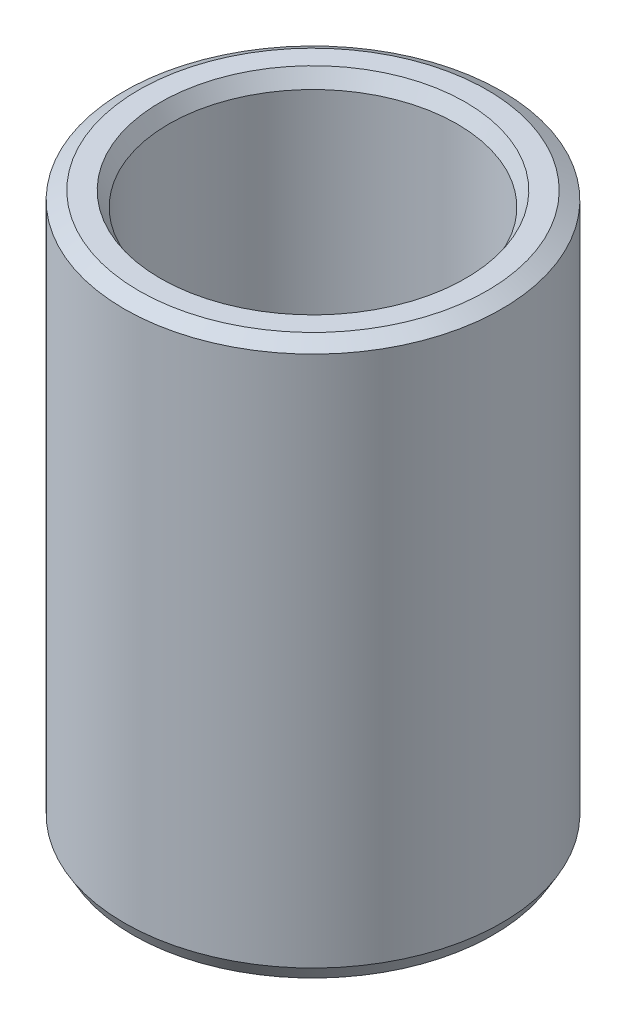
ISO-10303-21;
HEADER;
FILE_DESCRIPTION(('STEP AP214'),'2;1');
FILE_NAME('part.step','',(''),(''),'','','');
FILE_SCHEMA(('AUTOMOTIVE_DESIGN { 1 0 10303 214 1 1 1 1 }'));
ENDSEC;
DATA;
#1=APPLICATION_CONTEXT('core data for automotive mechanical design processes');
#2=APPLICATION_PROTOCOL_DEFINITION('international standard','automotive_design',2000,#1);
#3=PRODUCT_CONTEXT('',#1,'mechanical');
#4=PRODUCT('Part','Part','',(#3));
#5=PRODUCT_RELATED_PRODUCT_CATEGORY('part','',(#4));
#6=PRODUCT_DEFINITION_FORMATION('','',#4);
#7=PRODUCT_DEFINITION_CONTEXT('part definition',#1,'design');
#8=PRODUCT_DEFINITION('design','',#6,#7);
#9=PRODUCT_DEFINITION_SHAPE('','',#8);
#10=(LENGTH_UNIT() NAMED_UNIT(*) SI_UNIT(.MILLI.,.METRE.));
#11=(NAMED_UNIT(*) PLANE_ANGLE_UNIT() SI_UNIT($,.RADIAN.));
#12=(NAMED_UNIT(*) SI_UNIT($,.STERADIAN.) SOLID_ANGLE_UNIT());
#13=UNCERTAINTY_MEASURE_WITH_UNIT(LENGTH_MEASURE(1.E-05),#10,'distance_accuracy_value','');
#14=(GEOMETRIC_REPRESENTATION_CONTEXT(3) GLOBAL_UNCERTAINTY_ASSIGNED_CONTEXT((#13)) GLOBAL_UNIT_ASSIGNED_CONTEXT((#10,
#11,#12)) REPRESENTATION_CONTEXT('',''));
#15=CARTESIAN_POINT('',(0.,0.,0.));
#16=DIRECTION('',(0.,0.,1.));
#17=DIRECTION('',(1.,0.,0.));
#18=AXIS2_PLACEMENT_3D('',#15,#16,#17);
#19=CARTESIAN_POINT('',(0.,73.4862176489075,0.));
#20=DIRECTION('',(0.,-1.,0.));
#21=DIRECTION('',(0.,0.,-1.));
#22=AXIS2_PLACEMENT_3D('',#19,#20,#21);
#23=CYLINDRICAL_SURFACE('',#22,25.);
#24=CARTESIAN_POINT('',(0.,1.93700564076275,0.));
#25=DIRECTION('',(0.,1.,0.));
#26=DIRECTION('',(0.,0.,1.));
#27=AXIS2_PLACEMENT_3D('',#24,#25,#26);
#28=CIRCLE('',#27,25.);
#29=CARTESIAN_POINT('',(0.,1.93700564076275,25.));
#30=VERTEX_POINT('',#29);
#31=EDGE_CURVE('E10',#30,#30,#28,.T.);
#32=ORIENTED_EDGE('',*,*,#31,.T.);
#33=EDGE_LOOP('',(#32));
#34=FACE_BOUND('',#33,.T.);
#35=CARTESIAN_POINT('',(0.,72.3678869207913,0.));
#36=DIRECTION('',(0.,1.,0.));
#37=DIRECTION('',(0.,0.,1.));
#38=AXIS2_PLACEMENT_3D('',#35,#36,#37);
#39=CIRCLE('',#38,25.);
#40=CARTESIAN_POINT('',(0.,72.3678869207913,25.));
#41=VERTEX_POINT('',#40);
#42=EDGE_CURVE('E50',#41,#41,#39,.F.);
#43=ORIENTED_EDGE('',*,*,#42,.T.);
#44=EDGE_LOOP('',(#43));
#45=FACE_BOUND('',#44,.T.);
#46=ADVANCED_FACE('F39',(#34,#45),#23,.T.);
#47=CARTESIAN_POINT('',(0.,73.4862176489075,0.));
#48=DIRECTION('',(0.,1.,0.));
#49=DIRECTION('',(0.,0.,1.));
#50=AXIS2_PLACEMENT_3D('',#47,#48,#49);
#51=PLANE('',#50);
#52=CARTESIAN_POINT('',(0.,73.4862176489075,0.));
#53=DIRECTION('',(0.,1.,0.));
#54=DIRECTION('',(0.,0.,1.));
#55=AXIS2_PLACEMENT_3D('',#52,#53,#54);
#56=CIRCLE('',#55,20.2172055169337);
#57=CARTESIAN_POINT('',(0.,73.4862176489075,20.2172055169337));
#58=VERTEX_POINT('',#57);
#59=EDGE_CURVE('E58',#58,#58,#56,.F.);
#60=ORIENTED_EDGE('',*,*,#59,.T.);
#61=EDGE_LOOP('',(#60));
#62=FACE_BOUND('',#61,.T.);
#63=CARTESIAN_POINT('',(0.,73.4862176489075,0.));
#64=DIRECTION('',(0.,1.,0.));
#65=DIRECTION('',(0.,0.,1.));
#66=AXIS2_PLACEMENT_3D('',#63,#64,#65);
#67=CIRCLE('',#66,23.0629943592372);
#68=CARTESIAN_POINT('',(0.,73.4862176489075,23.0629943592372));
#69=VERTEX_POINT('',#68);
#70=EDGE_CURVE('E61',#69,#69,#67,.T.);
#71=ORIENTED_EDGE('',*,*,#70,.T.);
#72=EDGE_LOOP('',(#71));
#73=FACE_BOUND('',#72,.T.);
#74=ADVANCED_FACE('F88',(#62,#73),#51,.T.);
#75=CARTESIAN_POINT('',(0.,0.,0.));
#76=DIRECTION('',(0.,1.,0.));
#77=DIRECTION('',(0.,0.,1.));
#78=AXIS2_PLACEMENT_3D('',#75,#76,#77);
#79=PLANE('',#78);
#80=CARTESIAN_POINT('',(0.,0.,0.));
#81=DIRECTION('',(0.,1.,0.));
#82=DIRECTION('',(0.,0.,1.));
#83=AXIS2_PLACEMENT_3D('',#80,#81,#82);
#84=CIRCLE('',#83,21.0358804295802);
#85=CARTESIAN_POINT('',(0.,0.,21.0358804295802));
#86=VERTEX_POINT('',#85);
#87=EDGE_CURVE('E51',#86,#86,#84,.T.);
#88=ORIENTED_EDGE('',*,*,#87,.T.);
#89=EDGE_LOOP('',(#88));
#90=FACE_BOUND('',#89,.T.);
#91=CARTESIAN_POINT('',(0.,0.,0.));
#92=DIRECTION('',(0.,1.,0.));
#93=DIRECTION('',(0.,0.,1.));
#94=AXIS2_PLACEMENT_3D('',#91,#92,#93);
#95=CIRCLE('',#94,23.8816692718838);
#96=CARTESIAN_POINT('',(0.,0.,23.8816692718838));
#97=VERTEX_POINT('',#96);
#98=EDGE_CURVE('E54',#97,#97,#95,.F.);
#99=ORIENTED_EDGE('',*,*,#98,.T.);
#100=EDGE_LOOP('',(#99));
#101=FACE_BOUND('',#100,.T.);
#102=ADVANCED_FACE('F83',(#90,#101),#79,.F.);
#103=CARTESIAN_POINT('',(0.,73.4862176489075,0.));
#104=DIRECTION('',(0.,-1.,0.));
#105=DIRECTION('',(0.,0.,-1.));
#106=AXIS2_PLACEMENT_3D('',#103,#104,#105);
#107=CYLINDRICAL_SURFACE('',#106,19.0988747888174);
#108=CARTESIAN_POINT('',(0.,71.5492120081447,0.));
#109=DIRECTION('',(0.,1.,0.));
#110=DIRECTION('',(0.,0.,1.));
#111=AXIS2_PLACEMENT_3D('',#108,#109,#110);
#112=CIRCLE('',#111,19.0988747888174);
#113=CARTESIAN_POINT('',(0.,71.5492120081447,19.0988747888174));
#114=VERTEX_POINT('',#113);
#115=EDGE_CURVE('E67',#114,#114,#112,.T.);
#116=ORIENTED_EDGE('',*,*,#115,.T.);
#117=EDGE_LOOP('',(#116));
#118=FACE_BOUND('',#117,.T.);
#119=CARTESIAN_POINT('',(0.,1.11833072811621,0.));
#120=DIRECTION('',(0.,1.,0.));
#121=DIRECTION('',(0.,0.,1.));
#122=AXIS2_PLACEMENT_3D('',#119,#120,#121);
#123=CIRCLE('',#122,19.0988747888174);
#124=CARTESIAN_POINT('',(0.,1.11833072811621,19.0988747888174));
#125=VERTEX_POINT('',#124);
#126=EDGE_CURVE('E69',#125,#125,#123,.F.);
#127=ORIENTED_EDGE('',*,*,#126,.T.);
#128=EDGE_LOOP('',(#127));
#129=FACE_BOUND('',#128,.T.);
#130=ADVANCED_FACE('F71',(#118,#129),#107,.F.);
#131=CARTESIAN_POINT('',(0.,71.5492120081447,0.));
#132=DIRECTION('',(0.,1.,0.));
#133=DIRECTION('',(0.,0.,1.));
#134=AXIS2_PLACEMENT_3D('',#131,#132,#133);
#135=CONICAL_SURFACE('',#134,19.0988747888174,0.523598775598299);
#136=ORIENTED_EDGE('',*,*,#59,.F.);
#137=EDGE_LOOP('',(#136));
#138=FACE_BOUND('',#137,.T.);
#139=ORIENTED_EDGE('',*,*,#115,.F.);
#140=EDGE_LOOP('',(#139));
#141=FACE_BOUND('',#140,.T.);
#142=ADVANCED_FACE('F77',(#138,#141),#135,.F.);
#143=CARTESIAN_POINT('',(0.,0.,0.));
#144=DIRECTION('',(0.,-1.,0.));
#145=DIRECTION('',(0.,0.,-1.));
#146=AXIS2_PLACEMENT_3D('',#143,#144,#145);
#147=CONICAL_SURFACE('',#146,21.0358804295802,1.04719755119659);
#148=ORIENTED_EDGE('',*,*,#126,.F.);
#149=EDGE_LOOP('',(#148));
#150=FACE_BOUND('',#149,.T.);
#151=ORIENTED_EDGE('',*,*,#87,.F.);
#152=EDGE_LOOP('',(#151));
#153=FACE_BOUND('',#152,.T.);
#154=ADVANCED_FACE('F73',(#150,#153),#147,.F.);
#155=CARTESIAN_POINT('',(0.,1.93700564076275,0.));
#156=DIRECTION('',(0.,1.,0.));
#157=DIRECTION('',(0.,0.,1.));
#158=AXIS2_PLACEMENT_3D('',#155,#156,#157);
#159=CONICAL_SURFACE('',#158,25.,0.523598775598302);
#160=CARTESIAN_POINT('',(0.,0.,23.8816692718838));
#161=CARTESIAN_POINT('',(0.,0.0201771420912782,23.8933185503017));
#162=CARTESIAN_POINT('',(0.,0.040354284182557,23.9049678287195));
#163=CARTESIAN_POINT('',(0.,0.0807085683651147,23.9282663855553));
#164=CARTESIAN_POINT('',(0.,0.100885710456394,23.9399156639732));
#165=CARTESIAN_POINT('',(0.,0.141239994638951,23.9632142208089));
#166=CARTESIAN_POINT('',(0.,0.161417136730229,23.9748634992268));
#167=CARTESIAN_POINT('',(0.,0.201771420912786,23.9981620560626));
#168=CARTESIAN_POINT('',(0.,0.221948563004065,24.0098113344804));
#169=CARTESIAN_POINT('',(0.,0.262302847186623,24.0331098913162));
#170=CARTESIAN_POINT('',(0.,0.282479989277901,24.0447591697341));
#171=CARTESIAN_POINT('',(0.,0.322834273460459,24.0680577265698));
#172=CARTESIAN_POINT('',(0.,0.343011415551738,24.0797070049877));
#173=CARTESIAN_POINT('',(0.,0.383365699734295,24.1030055618235));
#174=CARTESIAN_POINT('',(0.,0.403542841825573,24.1146548402413));
#175=CARTESIAN_POINT('',(0.,0.443897126008131,24.1379533970771));
#176=CARTESIAN_POINT('',(0.,0.464074268099409,24.149602675495));
#177=CARTESIAN_POINT('',(0.,0.504428552281967,24.1729012323307));
#178=CARTESIAN_POINT('',(0.,0.524605694373246,24.1845505107486));
#179=CARTESIAN_POINT('',(0.,0.564959978555803,24.2078490675844));
#180=CARTESIAN_POINT('',(0.,0.585137120647082,24.2194983460022));
#181=CARTESIAN_POINT('',(0.,0.625491404829639,24.242796902838));
#182=CARTESIAN_POINT('',(0.,0.645668546920918,24.2544461812559));
#183=CARTESIAN_POINT('',(0.,0.686022831103475,24.2777447380916));
#184=CARTESIAN_POINT('',(0.,0.706199973194754,24.2893940165095));
#185=CARTESIAN_POINT('',(0.,0.746554257377311,24.3126925733452));
#186=CARTESIAN_POINT('',(0.,0.76673139946859,24.3243418517631));
#187=CARTESIAN_POINT('',(0.,0.807085683651147,24.3476404085989));
#188=CARTESIAN_POINT('',(0.,0.827262825742426,24.3592896870168));
#189=CARTESIAN_POINT('',(0.,0.867617109924984,24.3825882438525));
#190=CARTESIAN_POINT('',(0.,0.887794252016262,24.3942375222704));
#191=CARTESIAN_POINT('',(0.,0.928148536198819,24.4175360791061));
#192=CARTESIAN_POINT('',(0.,0.948325678290098,24.429185357524));
#193=CARTESIAN_POINT('',(0.,0.988679962472656,24.4524839143598));
#194=CARTESIAN_POINT('',(0.,1.00885710456393,24.4641331927777));
#195=CARTESIAN_POINT('',(0.,1.04921138874649,24.4874317496134));
#196=CARTESIAN_POINT('',(0.,1.06938853083777,24.4990810280313));
#197=CARTESIAN_POINT('',(0.,1.10974281502033,24.522379584867));
#198=CARTESIAN_POINT('',(0.,1.12991995711161,24.5340288632849));
#199=CARTESIAN_POINT('',(0.,1.17027424129416,24.5573274201207));
#200=CARTESIAN_POINT('',(0.,1.19045138338544,24.5689766985385));
#201=CARTESIAN_POINT('',(0.,1.230805667568,24.5922752553743));
#202=CARTESIAN_POINT('',(0.,1.25098280965928,24.6039245337922));
#203=CARTESIAN_POINT('',(0.,1.29133709384184,24.6272230906279));
#204=CARTESIAN_POINT('',(0.,1.31151423593312,24.6388723690458));
#205=CARTESIAN_POINT('',(0.,1.35186852011567,24.6621709258816));
#206=CARTESIAN_POINT('',(0.,1.37204566220695,24.6738202042994));
#207=CARTESIAN_POINT('',(0.,1.41239994638951,24.6971187611352));
#208=CARTESIAN_POINT('',(0.,1.43257708848079,24.7087680395531));
#209=CARTESIAN_POINT('',(0.,1.47293137266334,24.7320665963888));
#210=CARTESIAN_POINT('',(0.,1.49310851475462,24.7437158748067));
#211=CARTESIAN_POINT('',(0.,1.53346279893718,24.7670144316425));
#212=CARTESIAN_POINT('',(0.,1.55363994102846,24.7786637100603));
#213=CARTESIAN_POINT('',(0.,1.59399422521102,24.8019622668961));
#214=CARTESIAN_POINT('',(0.,1.61417136730229,24.813611545314));
#215=CARTESIAN_POINT('',(0.,1.65452565148485,24.8369101021497));
#216=CARTESIAN_POINT('',(0.,1.67470279357613,24.8485593805676));
#217=CARTESIAN_POINT('',(0.,1.71505707775869,24.8718579374034));
#218=CARTESIAN_POINT('',(0.,1.73523421984997,24.8835072158212));
#219=CARTESIAN_POINT('',(0.,1.77558850403252,24.906805772657));
#220=CARTESIAN_POINT('',(0.,1.7957656461238,24.9184550510749));
#221=CARTESIAN_POINT('',(0.,1.83611993030636,24.9417536079106));
#222=CARTESIAN_POINT('',(0.,1.85629707239764,24.9534028863285));
#223=CARTESIAN_POINT('',(0.,1.8966513565802,24.9767014431642));
#224=CARTESIAN_POINT('',(0.,1.91682849867147,24.9883507215821));
#225=CARTESIAN_POINT('',(0.,1.93700564076275,25.));
#226=B_SPLINE_CURVE_WITH_KNOTS('',3,(#160,#161,#162,#163,#164,#165,#166,#167,#168,#169,#170,
#171,#172,#173,#174,#175,#176,#177,#178,#179,#180,#181,#182,#183,#184,#185,#186,#187,#188,#189,
#190,#191,#192,#193,#194,#195,#196,#197,#198,#199,#200,#201,#202,#203,#204,#205,#206,#207,#208,
#209,#210,#211,#212,#213,#214,#215,#216,#217,#218,#219,#220,#221,#222,#223,#224,#225),
.UNSPECIFIED.,.F.,.F.,(4,2,2,2,2,2,2,2,2,2,2,2,2,2,2,2,2,2,2,2,2,2,2,2,2,2,2,2,2,2,2,2,4),(0.,
0.0698956705072621,0.139791341014524,0.209687011521788,0.27958268202905,0.349478352536312,
0.419374023043575,0.489269693550839,0.559165364058101,0.629061034565363,0.698956705072625,
0.768852375579889,0.838748046087151,0.908643716594413,0.978539387101675,1.04843505760894,
1.1183307281162,1.18822639862346,1.25812206913073,1.32801773963799,1.39791341014525,
1.46780908065251,1.53770475115978,1.60760042166704,1.6774960921743,1.74739176268156,
1.81728743318883,1.88718310369609,1.95707877420335,2.02697444471061,2.09687011521788,
2.16676578572514,2.2366614562324),.UNSPECIFIED.);
#227=EDGE_CURVE('BSEAM76',#97,#30,#226,.T.);
#228=ORIENTED_EDGE('',*,*,#98,.F.);
#229=ORIENTED_EDGE('',*,*,#31,.F.);
#230=ORIENTED_EDGE('',*,*,#227,.T.);
#231=ORIENTED_EDGE('',*,*,#227,.F.);
#232=EDGE_LOOP('',(#228,#230,#229,#231));
#233=FACE_BOUND('',#232,.T.);
#234=ADVANCED_FACE('F76',(#233),#159,.T.);
#235=CARTESIAN_POINT('',(0.,73.4862176489075,0.));
#236=DIRECTION('',(0.,-1.,0.));
#237=DIRECTION('',(0.,0.,-1.));
#238=AXIS2_PLACEMENT_3D('',#235,#236,#237);
#239=CONICAL_SURFACE('',#238,23.0629943592372,1.0471975511966);
#240=ORIENTED_EDGE('',*,*,#42,.F.);
#241=EDGE_LOOP('',(#240));
#242=FACE_BOUND('',#241,.T.);
#243=ORIENTED_EDGE('',*,*,#70,.F.);
#244=EDGE_LOOP('',(#243));
#245=FACE_BOUND('',#244,.T.);
#246=ADVANCED_FACE('F45',(#242,#245),#239,.T.);
#247=CLOSED_SHELL('',(#46,#74,#102,#130,#142,#154,#234,#246));
#248=MANIFOLD_SOLID_BREP('B2',#247);
#249=ADVANCED_BREP_SHAPE_REPRESENTATION('',(#18,#248),#14);
#250=SHAPE_DEFINITION_REPRESENTATION(#9,#249);
ENDSEC;
END-ISO-10303-21;
